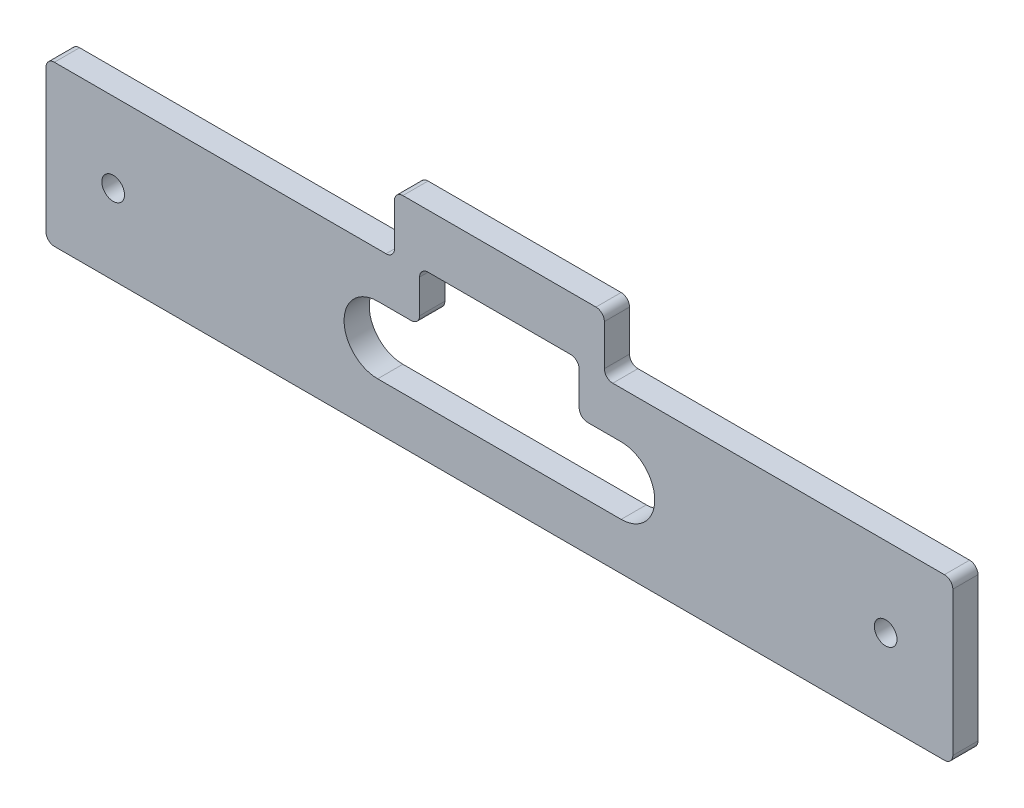
ISO-10303-21;
HEADER;
FILE_DESCRIPTION(('STEP AP214'),'2;1');
FILE_NAME('part.step','',(''),(''),'','','');
FILE_SCHEMA(('AUTOMOTIVE_DESIGN { 1 0 10303 214 1 1 1 1 }'));
ENDSEC;
DATA;
#1=APPLICATION_CONTEXT('core data for automotive mechanical design processes');
#2=APPLICATION_PROTOCOL_DEFINITION('international standard','automotive_design',2000,#1);
#3=PRODUCT_CONTEXT('',#1,'mechanical');
#4=PRODUCT('Part','Part','',(#3));
#5=PRODUCT_RELATED_PRODUCT_CATEGORY('part','',(#4));
#6=PRODUCT_DEFINITION_FORMATION('','',#4);
#7=PRODUCT_DEFINITION_CONTEXT('part definition',#1,'design');
#8=PRODUCT_DEFINITION('design','',#6,#7);
#9=PRODUCT_DEFINITION_SHAPE('','',#8);
#10=(LENGTH_UNIT() NAMED_UNIT(*) SI_UNIT(.MILLI.,.METRE.));
#11=(NAMED_UNIT(*) PLANE_ANGLE_UNIT() SI_UNIT($,.RADIAN.));
#12=(NAMED_UNIT(*) SI_UNIT($,.STERADIAN.) SOLID_ANGLE_UNIT());
#13=UNCERTAINTY_MEASURE_WITH_UNIT(LENGTH_MEASURE(1.E-05),#10,'distance_accuracy_value','');
#14=(GEOMETRIC_REPRESENTATION_CONTEXT(3) GLOBAL_UNCERTAINTY_ASSIGNED_CONTEXT((#13)) GLOBAL_UNIT_ASSIGNED_CONTEXT((#10,
#11,#12)) REPRESENTATION_CONTEXT('',''));
#15=CARTESIAN_POINT('',(0.,0.,0.));
#16=DIRECTION('',(0.,0.,1.));
#17=DIRECTION('',(1.,0.,0.));
#18=AXIS2_PLACEMENT_3D('',#15,#16,#17);
#19=CARTESIAN_POINT('',(0.,0.,15.));
#20=DIRECTION('',(1.,0.,0.));
#21=DIRECTION('',(0.,0.,-1.));
#22=AXIS2_PLACEMENT_3D('',#19,#20,#21);
#23=PLANE('',#22);
#24=DIRECTION('',(0.,-1.,0.));
#25=VECTOR('',#24,1.);
#26=CARTESIAN_POINT('',(0.,0.,15.));
#27=LINE('',#26,#25);
#28=CARTESIAN_POINT('',(0.,90.,15.));
#29=VERTEX_POINT('',#28);
#30=CARTESIAN_POINT('',(0.,5.,15.));
#31=VERTEX_POINT('',#30);
#32=EDGE_CURVE('E304',#29,#31,#27,.T.);
#33=ORIENTED_EDGE('',*,*,#32,.F.);
#34=DIRECTION('',(0.,0.,-1.));
#35=VECTOR('',#34,1.);
#36=CARTESIAN_POINT('',(0.,90.,15.));
#37=LINE('',#36,#35);
#38=CARTESIAN_POINT('',(0.,90.,0.));
#39=VERTEX_POINT('',#38);
#40=EDGE_CURVE('E421',#29,#39,#37,.T.);
#41=ORIENTED_EDGE('',*,*,#40,.T.);
#42=DIRECTION('',(0.,-1.,0.));
#43=VECTOR('',#42,1.);
#44=CARTESIAN_POINT('',(0.,0.,0.));
#45=LINE('',#44,#43);
#46=CARTESIAN_POINT('',(0.,5.,0.));
#47=VERTEX_POINT('',#46);
#48=EDGE_CURVE('E303',#39,#47,#45,.T.);
#49=ORIENTED_EDGE('',*,*,#48,.T.);
#50=DIRECTION('',(0.,0.,-1.));
#51=VECTOR('',#50,1.);
#52=CARTESIAN_POINT('',(0.,5.,15.));
#53=LINE('',#52,#51);
#54=EDGE_CURVE('E419',#47,#31,#53,.F.);
#55=ORIENTED_EDGE('',*,*,#54,.T.);
#56=EDGE_LOOP('',(#33,#41,#49,#55));
#57=FACE_BOUND('',#56,.T.);
#58=ADVANCED_FACE('F45',(#57),#23,.F.);
#59=CARTESIAN_POINT('',(0.,0.,15.));
#60=DIRECTION('',(0.,1.,0.));
#61=DIRECTION('',(0.,0.,1.));
#62=AXIS2_PLACEMENT_3D('',#59,#60,#61);
#63=PLANE('',#62);
#64=DIRECTION('',(1.,0.,0.));
#65=VECTOR('',#64,1.);
#66=CARTESIAN_POINT('',(0.,0.,15.));
#67=LINE('',#66,#65);
#68=CARTESIAN_POINT('',(5.,0.,15.));
#69=VERTEX_POINT('',#68);
#70=CARTESIAN_POINT('',(534.999504610655,0.,15.));
#71=VERTEX_POINT('',#70);
#72=EDGE_CURVE('E307',#69,#71,#67,.T.);
#73=ORIENTED_EDGE('',*,*,#72,.F.);
#74=DIRECTION('',(0.,0.,-1.));
#75=VECTOR('',#74,1.);
#76=CARTESIAN_POINT('',(5.,0.,15.));
#77=LINE('',#76,#75);
#78=CARTESIAN_POINT('',(5.,0.,0.));
#79=VERTEX_POINT('',#78);
#80=EDGE_CURVE('E443',#69,#79,#77,.T.);
#81=ORIENTED_EDGE('',*,*,#80,.T.);
#82=DIRECTION('',(1.,0.,0.));
#83=VECTOR('',#82,1.);
#84=CARTESIAN_POINT('',(0.,0.,0.));
#85=LINE('',#84,#83);
#86=CARTESIAN_POINT('',(534.999504610655,0.,0.));
#87=VERTEX_POINT('',#86);
#88=EDGE_CURVE('E330',#79,#87,#85,.T.);
#89=ORIENTED_EDGE('',*,*,#88,.T.);
#90=DIRECTION('',(0.,0.,-1.));
#91=VECTOR('',#90,1.);
#92=CARTESIAN_POINT('',(534.999504610655,0.,15.));
#93=LINE('',#92,#91);
#94=EDGE_CURVE('E441',#87,#71,#93,.F.);
#95=ORIENTED_EDGE('',*,*,#94,.T.);
#96=EDGE_LOOP('',(#73,#81,#89,#95));
#97=FACE_BOUND('',#96,.T.);
#98=ADVANCED_FACE('F511',(#97),#63,.F.);
#99=CARTESIAN_POINT('',(539.999504610655,0.,15.));
#100=DIRECTION('',(-1.,0.,0.));
#101=DIRECTION('',(0.,0.,1.));
#102=AXIS2_PLACEMENT_3D('',#99,#100,#101);
#103=PLANE('',#102);
#104=DIRECTION('',(0.,1.,0.));
#105=VECTOR('',#104,1.);
#106=CARTESIAN_POINT('',(539.999504610655,0.,15.));
#107=LINE('',#106,#105);
#108=CARTESIAN_POINT('',(539.999504610655,5.,15.));
#109=VERTEX_POINT('',#108);
#110=CARTESIAN_POINT('',(539.999504610655,90.7314507823298,15.));
#111=VERTEX_POINT('',#110);
#112=EDGE_CURVE('E311',#109,#111,#107,.T.);
#113=ORIENTED_EDGE('',*,*,#112,.F.);
#114=DIRECTION('',(0.,0.,-1.));
#115=VECTOR('',#114,1.);
#116=CARTESIAN_POINT('',(539.999504610655,5.,15.));
#117=LINE('',#116,#115);
#118=CARTESIAN_POINT('',(539.999504610655,5.,0.));
#119=VERTEX_POINT('',#118);
#120=EDGE_CURVE('E53',#109,#119,#117,.T.);
#121=ORIENTED_EDGE('',*,*,#120,.T.);
#122=DIRECTION('',(0.,1.,0.));
#123=VECTOR('',#122,1.);
#124=CARTESIAN_POINT('',(539.999504610655,0.,0.));
#125=LINE('',#124,#123);
#126=CARTESIAN_POINT('',(539.999504610655,90.7314507823298,0.));
#127=VERTEX_POINT('',#126);
#128=EDGE_CURVE('E333',#119,#127,#125,.T.);
#129=ORIENTED_EDGE('',*,*,#128,.T.);
#130=DIRECTION('',(0.,0.,-1.));
#131=VECTOR('',#130,1.);
#132=CARTESIAN_POINT('',(539.999504610655,90.7314507823298,15.));
#133=LINE('',#132,#131);
#134=EDGE_CURVE('E68',#127,#111,#133,.F.);
#135=ORIENTED_EDGE('',*,*,#134,.T.);
#136=EDGE_LOOP('',(#113,#121,#129,#135));
#137=FACE_BOUND('',#136,.T.);
#138=ADVANCED_FACE('F449',(#137),#103,.F.);
#139=CARTESIAN_POINT('',(332.5,95.7314507823298,15.));
#140=DIRECTION('',(0.,-1.,0.));
#141=DIRECTION('',(0.,0.,-1.));
#142=AXIS2_PLACEMENT_3D('',#139,#140,#141);
#143=PLANE('',#142);
#144=DIRECTION('',(-1.,0.,0.));
#145=VECTOR('',#144,1.);
#146=CARTESIAN_POINT('',(332.5,95.7314507823298,15.));
#147=LINE('',#146,#145);
#148=CARTESIAN_POINT('',(534.999504610655,95.7314507823298,15.));
#149=VERTEX_POINT('',#148);
#150=CARTESIAN_POINT('',(337.5,95.7314507823298,15.));
#151=VERTEX_POINT('',#150);
#152=EDGE_CURVE('E313',#149,#151,#147,.T.);
#153=ORIENTED_EDGE('',*,*,#152,.F.);
#154=DIRECTION('',(0.,0.,-1.));
#155=VECTOR('',#154,1.);
#156=CARTESIAN_POINT('',(534.999504610655,95.7314507823298,15.));
#157=LINE('',#156,#155);
#158=CARTESIAN_POINT('',(534.999504610655,95.7314507823298,0.));
#159=VERTEX_POINT('',#158);
#160=EDGE_CURVE('E13',#149,#159,#157,.T.);
#161=ORIENTED_EDGE('',*,*,#160,.T.);
#162=DIRECTION('',(-1.,0.,0.));
#163=VECTOR('',#162,1.);
#164=CARTESIAN_POINT('',(332.5,95.7314507823298,0.));
#165=LINE('',#164,#163);
#166=CARTESIAN_POINT('',(337.5,95.7314507823298,0.));
#167=VERTEX_POINT('',#166);
#168=EDGE_CURVE('E335',#159,#167,#165,.T.);
#169=ORIENTED_EDGE('',*,*,#168,.T.);
#170=DIRECTION('',(0.,0.,-1.));
#171=VECTOR('',#170,1.);
#172=CARTESIAN_POINT('',(337.5,95.7314507823298,15.));
#173=LINE('',#172,#171);
#174=EDGE_CURVE('E352',#167,#151,#173,.F.);
#175=ORIENTED_EDGE('',*,*,#174,.T.);
#176=EDGE_LOOP('',(#153,#161,#169,#175));
#177=FACE_BOUND('',#176,.T.);
#178=ADVANCED_FACE('F459',(#177),#143,.F.);
#179=CARTESIAN_POINT('',(332.5,130.,15.));
#180=DIRECTION('',(-1.,0.,0.));
#181=DIRECTION('',(0.,-1.,0.));
#182=AXIS2_PLACEMENT_3D('',#179,#180,#181);
#183=PLANE('',#182);
#184=DIRECTION('',(0.,1.,0.));
#185=VECTOR('',#184,1.);
#186=CARTESIAN_POINT('',(332.5,130.,15.));
#187=LINE('',#186,#185);
#188=CARTESIAN_POINT('',(332.5,100.73145078233,15.));
#189=VERTEX_POINT('',#188);
#190=CARTESIAN_POINT('',(332.5,125.,15.));
#191=VERTEX_POINT('',#190);
#192=EDGE_CURVE('E315',#189,#191,#187,.T.);
#193=ORIENTED_EDGE('',*,*,#192,.F.);
#194=DIRECTION('',(0.,0.,-1.));
#195=VECTOR('',#194,1.);
#196=CARTESIAN_POINT('',(332.5,100.73145078233,0.));
#197=LINE('',#196,#195);
#198=CARTESIAN_POINT('',(332.5,100.73145078233,0.));
#199=VERTEX_POINT('',#198);
#200=EDGE_CURVE('E349',#189,#199,#197,.T.);
#201=ORIENTED_EDGE('',*,*,#200,.T.);
#202=DIRECTION('',(0.,1.,0.));
#203=VECTOR('',#202,1.);
#204=CARTESIAN_POINT('',(332.5,130.,0.));
#205=LINE('',#204,#203);
#206=CARTESIAN_POINT('',(332.5,125.,0.));
#207=VERTEX_POINT('',#206);
#208=EDGE_CURVE('E337',#199,#207,#205,.T.);
#209=ORIENTED_EDGE('',*,*,#208,.T.);
#210=DIRECTION('',(0.,0.,-1.));
#211=VECTOR('',#210,1.);
#212=CARTESIAN_POINT('',(332.5,125.,15.));
#213=LINE('',#212,#211);
#214=EDGE_CURVE('E327',#207,#191,#213,.F.);
#215=ORIENTED_EDGE('',*,*,#214,.T.);
#216=EDGE_LOOP('',(#193,#201,#209,#215));
#217=FACE_BOUND('',#216,.T.);
#218=ADVANCED_FACE('F468',(#217),#183,.F.);
#219=CARTESIAN_POINT('',(207.5,130.,15.));
#220=DIRECTION('',(0.,-1.,0.));
#221=DIRECTION('',(0.,0.,-1.));
#222=AXIS2_PLACEMENT_3D('',#219,#220,#221);
#223=PLANE('',#222);
#224=DIRECTION('',(-1.,0.,0.));
#225=VECTOR('',#224,1.);
#226=CARTESIAN_POINT('',(207.5,130.,15.));
#227=LINE('',#226,#225);
#228=CARTESIAN_POINT('',(327.5,130.,15.));
#229=VERTEX_POINT('',#228);
#230=CARTESIAN_POINT('',(212.5,130.,15.));
#231=VERTEX_POINT('',#230);
#232=EDGE_CURVE('E318',#229,#231,#227,.T.);
#233=ORIENTED_EDGE('',*,*,#232,.F.);
#234=DIRECTION('',(0.,0.,-1.));
#235=VECTOR('',#234,1.);
#236=CARTESIAN_POINT('',(327.5,130.,15.));
#237=LINE('',#236,#235);
#238=CARTESIAN_POINT('',(327.5,130.,0.));
#239=VERTEX_POINT('',#238);
#240=EDGE_CURVE('E357',#229,#239,#237,.T.);
#241=ORIENTED_EDGE('',*,*,#240,.T.);
#242=DIRECTION('',(-1.,0.,0.));
#243=VECTOR('',#242,1.);
#244=CARTESIAN_POINT('',(207.5,130.,0.));
#245=LINE('',#244,#243);
#246=CARTESIAN_POINT('',(212.5,130.,0.));
#247=VERTEX_POINT('',#246);
#248=EDGE_CURVE('E340',#239,#247,#245,.T.);
#249=ORIENTED_EDGE('',*,*,#248,.T.);
#250=DIRECTION('',(0.,0.,-1.));
#251=VECTOR('',#250,1.);
#252=CARTESIAN_POINT('',(212.5,130.,15.));
#253=LINE('',#252,#251);
#254=EDGE_CURVE('E355',#247,#231,#253,.F.);
#255=ORIENTED_EDGE('',*,*,#254,.T.);
#256=EDGE_LOOP('',(#233,#241,#249,#255));
#257=FACE_BOUND('',#256,.T.);
#258=ADVANCED_FACE('F479',(#257),#223,.F.);
#259=CARTESIAN_POINT('',(207.5,95.,15.));
#260=DIRECTION('',(1.,0.,0.));
#261=DIRECTION('',(0.,0.,-1.));
#262=AXIS2_PLACEMENT_3D('',#259,#260,#261);
#263=PLANE('',#262);
#264=DIRECTION('',(0.,-1.,0.));
#265=VECTOR('',#264,1.);
#266=CARTESIAN_POINT('',(207.5,95.,15.));
#267=LINE('',#266,#265);
#268=CARTESIAN_POINT('',(207.5,125.,15.));
#269=VERTEX_POINT('',#268);
#270=CARTESIAN_POINT('',(207.5,100.,15.));
#271=VERTEX_POINT('',#270);
#272=EDGE_CURVE('E321',#269,#271,#267,.T.);
#273=ORIENTED_EDGE('',*,*,#272,.F.);
#274=DIRECTION('',(0.,0.,-1.));
#275=VECTOR('',#274,1.);
#276=CARTESIAN_POINT('',(207.5,125.,15.));
#277=LINE('',#276,#275);
#278=CARTESIAN_POINT('',(207.5,125.,0.));
#279=VERTEX_POINT('',#278);
#280=EDGE_CURVE('E370',#269,#279,#277,.T.);
#281=ORIENTED_EDGE('',*,*,#280,.T.);
#282=DIRECTION('',(0.,-1.,0.));
#283=VECTOR('',#282,1.);
#284=CARTESIAN_POINT('',(207.5,95.,0.));
#285=LINE('',#284,#283);
#286=CARTESIAN_POINT('',(207.5,100.,0.));
#287=VERTEX_POINT('',#286);
#288=EDGE_CURVE('E343',#279,#287,#285,.T.);
#289=ORIENTED_EDGE('',*,*,#288,.T.);
#290=DIRECTION('',(0.,0.,-1.));
#291=VECTOR('',#290,1.);
#292=CARTESIAN_POINT('',(207.5,100.,15.));
#293=LINE('',#292,#291);
#294=EDGE_CURVE('E368',#287,#271,#293,.F.);
#295=ORIENTED_EDGE('',*,*,#294,.T.);
#296=EDGE_LOOP('',(#273,#281,#289,#295));
#297=FACE_BOUND('',#296,.T.);
#298=ADVANCED_FACE('F487',(#297),#263,.F.);
#299=CARTESIAN_POINT('',(0.,95.,15.));
#300=DIRECTION('',(0.,-1.,0.));
#301=DIRECTION('',(0.,0.,-1.));
#302=AXIS2_PLACEMENT_3D('',#299,#300,#301);
#303=PLANE('',#302);
#304=DIRECTION('',(-1.,0.,0.));
#305=VECTOR('',#304,1.);
#306=CARTESIAN_POINT('',(0.,95.,0.));
#307=LINE('',#306,#305);
#308=CARTESIAN_POINT('',(202.5,95.,0.));
#309=VERTEX_POINT('',#308);
#310=CARTESIAN_POINT('',(5.,95.,0.));
#311=VERTEX_POINT('',#310);
#312=EDGE_CURVE('E308',#309,#311,#307,.T.);
#313=ORIENTED_EDGE('',*,*,#312,.T.);
#314=DIRECTION('',(0.,0.,-1.));
#315=VECTOR('',#314,1.);
#316=CARTESIAN_POINT('',(5.,95.,15.));
#317=LINE('',#316,#315);
#318=CARTESIAN_POINT('',(5.,95.,15.));
#319=VERTEX_POINT('',#318);
#320=EDGE_CURVE('E432',#311,#319,#317,.F.);
#321=ORIENTED_EDGE('',*,*,#320,.T.);
#322=DIRECTION('',(-1.,0.,0.));
#323=VECTOR('',#322,1.);
#324=CARTESIAN_POINT('',(0.,95.,15.));
#325=LINE('',#324,#323);
#326=CARTESIAN_POINT('',(202.5,95.,15.));
#327=VERTEX_POINT('',#326);
#328=EDGE_CURVE('E324',#327,#319,#325,.T.);
#329=ORIENTED_EDGE('',*,*,#328,.F.);
#330=DIRECTION('',(0.,0.,-1.));
#331=VECTOR('',#330,1.);
#332=CARTESIAN_POINT('',(202.5,95.,0.));
#333=LINE('',#332,#331);
#334=EDGE_CURVE('E373',#327,#309,#333,.T.);
#335=ORIENTED_EDGE('',*,*,#334,.T.);
#336=EDGE_LOOP('',(#313,#321,#329,#335));
#337=FACE_BOUND('',#336,.T.);
#338=ADVANCED_FACE('F496',(#337),#303,.F.);
#339=CARTESIAN_POINT('',(0.,0.,15.));
#340=DIRECTION('',(0.,0.,-1.));
#341=DIRECTION('',(-1.,0.,0.));
#342=AXIS2_PLACEMENT_3D('',#339,#340,#341);
#343=PLANE('',#342);
#344=DIRECTION('',(0.,-1.,0.));
#345=VECTOR('',#344,1.);
#346=CARTESIAN_POINT('',(317.499504610655,0.,15.));
#347=LINE('',#346,#345);
#348=CARTESIAN_POINT('',(317.499504610655,93.,15.));
#349=VERTEX_POINT('',#348);
#350=CARTESIAN_POINT('',(317.499504610655,73.,15.));
#351=VERTEX_POINT('',#350);
#352=EDGE_CURVE('E279',#349,#351,#347,.T.);
#353=ORIENTED_EDGE('',*,*,#352,.T.);
#354=CARTESIAN_POINT('',(322.499504610655,73.,15.));
#355=DIRECTION('',(0.,0.,-1.));
#356=DIRECTION('',(-1.,0.,0.));
#357=AXIS2_PLACEMENT_3D('',#354,#355,#356);
#358=CIRCLE('',#357,5.);
#359=CARTESIAN_POINT('',(322.499504610655,68.,15.));
#360=VERTEX_POINT('',#359);
#361=EDGE_CURVE('E397',#351,#360,#358,.F.);
#362=ORIENTED_EDGE('',*,*,#361,.T.);
#363=DIRECTION('',(1.,0.,0.));
#364=VECTOR('',#363,1.);
#365=CARTESIAN_POINT('',(0.,68.,15.));
#366=LINE('',#365,#364);
#367=CARTESIAN_POINT('',(342.499504610655,68.,15.));
#368=VERTEX_POINT('',#367);
#369=EDGE_CURVE('E282',#360,#368,#366,.T.);
#370=ORIENTED_EDGE('',*,*,#369,.T.);
#371=CARTESIAN_POINT('',(342.499504610655,48.,15.));
#372=DIRECTION('',(0.,0.,-1.));
#373=DIRECTION('',(-1.,0.,0.));
#374=AXIS2_PLACEMENT_3D('',#371,#372,#373);
#375=CIRCLE('',#374,20.);
#376=CARTESIAN_POINT('',(342.499504610655,28.,15.));
#377=VERTEX_POINT('',#376);
#378=EDGE_CURVE('E252',#368,#377,#375,.T.);
#379=ORIENTED_EDGE('',*,*,#378,.T.);
#380=DIRECTION('',(-1.,0.,0.));
#381=VECTOR('',#380,1.);
#382=CARTESIAN_POINT('',(0.,28.,15.));
#383=LINE('',#382,#381);
#384=CARTESIAN_POINT('',(197.499504610655,28.,15.));
#385=VERTEX_POINT('',#384);
#386=EDGE_CURVE('E285',#377,#385,#383,.T.);
#387=ORIENTED_EDGE('',*,*,#386,.T.);
#388=CARTESIAN_POINT('',(197.499504610655,48.,15.));
#389=DIRECTION('',(0.,0.,-1.));
#390=DIRECTION('',(-1.,0.,0.));
#391=AXIS2_PLACEMENT_3D('',#388,#389,#390);
#392=CIRCLE('',#391,20.);
#393=CARTESIAN_POINT('',(197.499504610655,68.,15.));
#394=VERTEX_POINT('',#393);
#395=EDGE_CURVE('E288',#385,#394,#392,.T.);
#396=ORIENTED_EDGE('',*,*,#395,.T.);
#397=DIRECTION('',(1.,0.,0.));
#398=VECTOR('',#397,1.);
#399=CARTESIAN_POINT('',(0.,68.,15.));
#400=LINE('',#399,#398);
#401=CARTESIAN_POINT('',(217.499504610655,68.,15.));
#402=VERTEX_POINT('',#401);
#403=EDGE_CURVE('E267',#394,#402,#400,.T.);
#404=ORIENTED_EDGE('',*,*,#403,.T.);
#405=CARTESIAN_POINT('',(217.499504610655,73.,15.));
#406=DIRECTION('',(0.,0.,-1.));
#407=DIRECTION('',(-1.,0.,0.));
#408=AXIS2_PLACEMENT_3D('',#405,#406,#407);
#409=CIRCLE('',#408,5.);
#410=CARTESIAN_POINT('',(222.499504610655,73.,15.));
#411=VERTEX_POINT('',#410);
#412=EDGE_CURVE('E395',#402,#411,#409,.F.);
#413=ORIENTED_EDGE('',*,*,#412,.T.);
#414=DIRECTION('',(0.,1.,0.));
#415=VECTOR('',#414,1.);
#416=CARTESIAN_POINT('',(222.499504610655,0.,15.));
#417=LINE('',#416,#415);
#418=CARTESIAN_POINT('',(222.499504610655,93.,15.));
#419=VERTEX_POINT('',#418);
#420=EDGE_CURVE('E273',#411,#419,#417,.T.);
#421=ORIENTED_EDGE('',*,*,#420,.T.);
#422=CARTESIAN_POINT('',(227.499504610655,93.,15.));
#423=DIRECTION('',(0.,0.,-1.));
#424=DIRECTION('',(-1.,0.,0.));
#425=AXIS2_PLACEMENT_3D('',#422,#423,#424);
#426=CIRCLE('',#425,5.);
#427=CARTESIAN_POINT('',(227.499504610655,98.,15.));
#428=VERTEX_POINT('',#427);
#429=EDGE_CURVE('E417',#419,#428,#426,.T.);
#430=ORIENTED_EDGE('',*,*,#429,.T.);
#431=DIRECTION('',(1.,0.,0.));
#432=VECTOR('',#431,1.);
#433=CARTESIAN_POINT('',(0.,98.,15.));
#434=LINE('',#433,#432);
#435=CARTESIAN_POINT('',(312.499504610655,98.,15.));
#436=VERTEX_POINT('',#435);
#437=EDGE_CURVE('E276',#428,#436,#434,.T.);
#438=ORIENTED_EDGE('',*,*,#437,.T.);
#439=CARTESIAN_POINT('',(312.499504610655,93.,15.));
#440=DIRECTION('',(0.,0.,-1.));
#441=DIRECTION('',(-1.,0.,0.));
#442=AXIS2_PLACEMENT_3D('',#439,#440,#441);
#443=CIRCLE('',#442,5.);
#444=EDGE_CURVE('E413',#436,#349,#443,.T.);
#445=ORIENTED_EDGE('',*,*,#444,.T.);
#446=EDGE_LOOP('',(#353,#362,#370,#379,#387,#396,#404,#413,#421,#430,#438,#445));
#447=FACE_BOUND('',#446,.T.);
#448=CARTESIAN_POINT('',(40.,47.5,15.));
#449=DIRECTION('',(0.,0.,-1.));
#450=DIRECTION('',(-1.,0.,0.));
#451=AXIS2_PLACEMENT_3D('',#448,#449,#450);
#452=CIRCLE('',#451,6.75);
#453=CARTESIAN_POINT('',(33.25,47.5,15.));
#454=VERTEX_POINT('',#453);
#455=EDGE_CURVE('E294',#454,#454,#452,.T.);
#456=ORIENTED_EDGE('',*,*,#455,.T.);
#457=EDGE_LOOP('',(#456));
#458=FACE_BOUND('',#457,.T.);
#459=CARTESIAN_POINT('',(499.999504610655,48.2314507823298,15.));
#460=DIRECTION('',(0.,0.,-1.));
#461=DIRECTION('',(-1.,0.,0.));
#462=AXIS2_PLACEMENT_3D('',#459,#460,#461);
#463=CIRCLE('',#462,6.74999999999998);
#464=CARTESIAN_POINT('',(493.249504610655,48.2314507823298,15.));
#465=VERTEX_POINT('',#464);
#466=EDGE_CURVE('E300',#465,#465,#463,.T.);
#467=ORIENTED_EDGE('',*,*,#466,.T.);
#468=EDGE_LOOP('',(#467));
#469=FACE_BOUND('',#468,.T.);
#470=ORIENTED_EDGE('',*,*,#328,.T.);
#471=CARTESIAN_POINT('',(5.,90.,15.));
#472=DIRECTION('',(0.,0.,-1.));
#473=DIRECTION('',(-1.,0.,0.));
#474=AXIS2_PLACEMENT_3D('',#471,#472,#473);
#475=CIRCLE('',#474,5.);
#476=EDGE_CURVE('E439',#319,#29,#475,.F.);
#477=ORIENTED_EDGE('',*,*,#476,.T.);
#478=ORIENTED_EDGE('',*,*,#32,.T.);
#479=CARTESIAN_POINT('',(5.,5.,15.));
#480=DIRECTION('',(0.,0.,-1.));
#481=DIRECTION('',(-1.,0.,0.));
#482=AXIS2_PLACEMENT_3D('',#479,#480,#481);
#483=CIRCLE('',#482,5.);
#484=EDGE_CURVE('E437',#31,#69,#483,.F.);
#485=ORIENTED_EDGE('',*,*,#484,.T.);
#486=ORIENTED_EDGE('',*,*,#72,.T.);
#487=CARTESIAN_POINT('',(534.999504610655,5.,15.));
#488=DIRECTION('',(0.,0.,-1.));
#489=DIRECTION('',(-1.,0.,0.));
#490=AXIS2_PLACEMENT_3D('',#487,#488,#489);
#491=CIRCLE('',#490,5.);
#492=EDGE_CURVE('E435',#71,#109,#491,.F.);
#493=ORIENTED_EDGE('',*,*,#492,.T.);
#494=ORIENTED_EDGE('',*,*,#112,.T.);
#495=CARTESIAN_POINT('',(534.999504610655,90.7314507823298,15.));
#496=DIRECTION('',(0.,0.,-1.));
#497=DIRECTION('',(-1.,0.,0.));
#498=AXIS2_PLACEMENT_3D('',#495,#496,#497);
#499=CIRCLE('',#498,5.);
#500=EDGE_CURVE('E60',#111,#149,#499,.F.);
#501=ORIENTED_EDGE('',*,*,#500,.T.);
#502=ORIENTED_EDGE('',*,*,#152,.T.);
#503=CARTESIAN_POINT('',(337.5,100.73145078233,15.));
#504=DIRECTION('',(0.,0.,-1.));
#505=DIRECTION('',(-1.,0.,0.));
#506=AXIS2_PLACEMENT_3D('',#503,#504,#505);
#507=CIRCLE('',#506,5.);
#508=EDGE_CURVE('E379',#151,#189,#507,.T.);
#509=ORIENTED_EDGE('',*,*,#508,.T.);
#510=ORIENTED_EDGE('',*,*,#192,.T.);
#511=CARTESIAN_POINT('',(327.5,125.,15.));
#512=DIRECTION('',(0.,0.,-1.));
#513=DIRECTION('',(-1.,0.,0.));
#514=AXIS2_PLACEMENT_3D('',#511,#512,#513);
#515=CIRCLE('',#514,5.);
#516=EDGE_CURVE('E366',#191,#229,#515,.F.);
#517=ORIENTED_EDGE('',*,*,#516,.T.);
#518=ORIENTED_EDGE('',*,*,#232,.T.);
#519=CARTESIAN_POINT('',(212.5,125.,15.));
#520=DIRECTION('',(0.,0.,-1.));
#521=DIRECTION('',(-1.,0.,0.));
#522=AXIS2_PLACEMENT_3D('',#519,#520,#521);
#523=CIRCLE('',#522,5.);
#524=EDGE_CURVE('E364',#231,#269,#523,.F.);
#525=ORIENTED_EDGE('',*,*,#524,.T.);
#526=ORIENTED_EDGE('',*,*,#272,.T.);
#527=CARTESIAN_POINT('',(202.5,100.,15.));
#528=DIRECTION('',(0.,0.,-1.));
#529=DIRECTION('',(-1.,0.,0.));
#530=AXIS2_PLACEMENT_3D('',#527,#528,#529);
#531=CIRCLE('',#530,5.);
#532=EDGE_CURVE('E383',#271,#327,#531,.T.);
#533=ORIENTED_EDGE('',*,*,#532,.T.);
#534=EDGE_LOOP('',(#470,#477,#478,#485,#486,#493,#494,#501,#502,#509,#510,#517,#518,#525,#526,#533));
#535=FACE_BOUND('',#534,.T.);
#536=ADVANCED_FACE('F462',(#447,#458,#469,#535),#343,.F.);
#537=CARTESIAN_POINT('',(0.,0.,0.));
#538=DIRECTION('',(0.,0.,-1.));
#539=DIRECTION('',(-1.,0.,0.));
#540=AXIS2_PLACEMENT_3D('',#537,#538,#539);
#541=PLANE('',#540);
#542=DIRECTION('',(1.,0.,0.));
#543=VECTOR('',#542,1.);
#544=CARTESIAN_POINT('',(342.499504610655,68.,0.));
#545=LINE('',#544,#543);
#546=CARTESIAN_POINT('',(322.499504610655,68.,0.));
#547=VERTEX_POINT('',#546);
#548=CARTESIAN_POINT('',(342.499504610655,68.,0.));
#549=VERTEX_POINT('',#548);
#550=EDGE_CURVE('E233',#547,#549,#545,.T.);
#551=ORIENTED_EDGE('',*,*,#550,.F.);
#552=CARTESIAN_POINT('',(322.499504610655,73.,0.));
#553=DIRECTION('',(0.,0.,-1.));
#554=DIRECTION('',(-1.,0.,0.));
#555=AXIS2_PLACEMENT_3D('',#552,#553,#554);
#556=CIRCLE('',#555,5.);
#557=CARTESIAN_POINT('',(317.499504610655,73.,0.));
#558=VERTEX_POINT('',#557);
#559=EDGE_CURVE('E388',#547,#558,#556,.T.);
#560=ORIENTED_EDGE('',*,*,#559,.T.);
#561=DIRECTION('',(0.,-1.,0.));
#562=VECTOR('',#561,1.);
#563=CARTESIAN_POINT('',(317.499504610655,68.,0.));
#564=LINE('',#563,#562);
#565=CARTESIAN_POINT('',(317.499504610655,93.,0.));
#566=VERTEX_POINT('',#565);
#567=EDGE_CURVE('E243',#566,#558,#564,.T.);
#568=ORIENTED_EDGE('',*,*,#567,.F.);
#569=CARTESIAN_POINT('',(312.499504610655,93.,0.));
#570=DIRECTION('',(0.,0.,-1.));
#571=DIRECTION('',(-1.,0.,0.));
#572=AXIS2_PLACEMENT_3D('',#569,#570,#571);
#573=CIRCLE('',#572,5.);
#574=CARTESIAN_POINT('',(312.499504610655,98.,0.));
#575=VERTEX_POINT('',#574);
#576=EDGE_CURVE('E411',#566,#575,#573,.F.);
#577=ORIENTED_EDGE('',*,*,#576,.T.);
#578=DIRECTION('',(1.,0.,0.));
#579=VECTOR('',#578,1.);
#580=CARTESIAN_POINT('',(317.499504610655,98.,0.));
#581=LINE('',#580,#579);
#582=CARTESIAN_POINT('',(227.499504610655,98.,0.));
#583=VERTEX_POINT('',#582);
#584=EDGE_CURVE('E809',#583,#575,#581,.T.);
#585=ORIENTED_EDGE('',*,*,#584,.F.);
#586=CARTESIAN_POINT('',(227.499504610655,93.,0.));
#587=DIRECTION('',(0.,0.,-1.));
#588=DIRECTION('',(-1.,0.,0.));
#589=AXIS2_PLACEMENT_3D('',#586,#587,#588);
#590=CIRCLE('',#589,5.);
#591=CARTESIAN_POINT('',(222.499504610655,93.,0.));
#592=VERTEX_POINT('',#591);
#593=EDGE_CURVE('E415',#583,#592,#590,.F.);
#594=ORIENTED_EDGE('',*,*,#593,.T.);
#595=DIRECTION('',(0.,1.,0.));
#596=VECTOR('',#595,1.);
#597=CARTESIAN_POINT('',(222.499504610655,98.,0.));
#598=LINE('',#597,#596);
#599=CARTESIAN_POINT('',(222.499504610655,73.,0.));
#600=VERTEX_POINT('',#599);
#601=EDGE_CURVE('E811',#600,#592,#598,.T.);
#602=ORIENTED_EDGE('',*,*,#601,.F.);
#603=CARTESIAN_POINT('',(217.499504610655,73.,0.));
#604=DIRECTION('',(0.,0.,-1.));
#605=DIRECTION('',(-1.,0.,0.));
#606=AXIS2_PLACEMENT_3D('',#603,#604,#605);
#607=CIRCLE('',#606,5.);
#608=CARTESIAN_POINT('',(217.499504610655,68.,0.));
#609=VERTEX_POINT('',#608);
#610=EDGE_CURVE('E386',#600,#609,#607,.T.);
#611=ORIENTED_EDGE('',*,*,#610,.T.);
#612=DIRECTION('',(1.,0.,0.));
#613=VECTOR('',#612,1.);
#614=CARTESIAN_POINT('',(222.499504610655,68.,0.));
#615=LINE('',#614,#613);
#616=CARTESIAN_POINT('',(197.499504610655,68.,0.));
#617=VERTEX_POINT('',#616);
#618=EDGE_CURVE('E816',#617,#609,#615,.T.);
#619=ORIENTED_EDGE('',*,*,#618,.F.);
#620=CARTESIAN_POINT('',(197.499504610655,48.,0.));
#621=DIRECTION('',(0.,0.,-1.));
#622=DIRECTION('',(1.,0.,0.));
#623=AXIS2_PLACEMENT_3D('',#620,#621,#622);
#624=CIRCLE('',#623,20.);
#625=CARTESIAN_POINT('',(197.499504610655,28.,0.));
#626=VERTEX_POINT('',#625);
#627=EDGE_CURVE('E819',#626,#617,#624,.T.);
#628=ORIENTED_EDGE('',*,*,#627,.F.);
#629=DIRECTION('',(-1.,0.,0.));
#630=VECTOR('',#629,1.);
#631=CARTESIAN_POINT('',(197.499504610655,28.,0.));
#632=LINE('',#631,#630);
#633=CARTESIAN_POINT('',(342.499504610655,28.,0.));
#634=VERTEX_POINT('',#633);
#635=EDGE_CURVE('E260',#634,#626,#632,.T.);
#636=ORIENTED_EDGE('',*,*,#635,.F.);
#637=CARTESIAN_POINT('',(342.499504610655,48.,0.));
#638=DIRECTION('',(0.,0.,-1.));
#639=DIRECTION('',(-1.,0.,0.));
#640=AXIS2_PLACEMENT_3D('',#637,#638,#639);
#641=CIRCLE('',#640,20.);
#642=EDGE_CURVE('E242',#549,#634,#641,.T.);
#643=ORIENTED_EDGE('',*,*,#642,.F.);
#644=EDGE_LOOP('',(#551,#560,#568,#577,#585,#594,#602,#611,#619,#628,#636,#643));
#645=FACE_BOUND('',#644,.T.);
#646=CARTESIAN_POINT('',(40.,47.5,0.));
#647=DIRECTION('',(0.,0.,-1.));
#648=DIRECTION('',(-1.,0.,0.));
#649=AXIS2_PLACEMENT_3D('',#646,#647,#648);
#650=CIRCLE('',#649,6.75);
#651=CARTESIAN_POINT('',(33.25,47.5,0.));
#652=VERTEX_POINT('',#651);
#653=EDGE_CURVE('E291',#652,#652,#650,.T.);
#654=ORIENTED_EDGE('',*,*,#653,.F.);
#655=EDGE_LOOP('',(#654));
#656=FACE_BOUND('',#655,.T.);
#657=CARTESIAN_POINT('',(499.999504610655,48.2314507823298,0.));
#658=DIRECTION('',(0.,0.,-1.));
#659=DIRECTION('',(-1.,0.,0.));
#660=AXIS2_PLACEMENT_3D('',#657,#658,#659);
#661=CIRCLE('',#660,6.74999999999998);
#662=CARTESIAN_POINT('',(493.249504610655,48.2314507823298,0.));
#663=VERTEX_POINT('',#662);
#664=EDGE_CURVE('E297',#663,#663,#661,.T.);
#665=ORIENTED_EDGE('',*,*,#664,.F.);
#666=EDGE_LOOP('',(#665));
#667=FACE_BOUND('',#666,.T.);
#668=ORIENTED_EDGE('',*,*,#48,.F.);
#669=CARTESIAN_POINT('',(5.,90.,0.));
#670=DIRECTION('',(0.,0.,-1.));
#671=DIRECTION('',(-1.,0.,0.));
#672=AXIS2_PLACEMENT_3D('',#669,#670,#671);
#673=CIRCLE('',#672,5.);
#674=EDGE_CURVE('E430',#39,#311,#673,.T.);
#675=ORIENTED_EDGE('',*,*,#674,.T.);
#676=ORIENTED_EDGE('',*,*,#312,.F.);
#677=CARTESIAN_POINT('',(202.5,100.,0.));
#678=DIRECTION('',(0.,0.,-1.));
#679=DIRECTION('',(-1.,0.,0.));
#680=AXIS2_PLACEMENT_3D('',#677,#678,#679);
#681=CIRCLE('',#680,5.);
#682=EDGE_CURVE('E381',#309,#287,#681,.F.);
#683=ORIENTED_EDGE('',*,*,#682,.T.);
#684=ORIENTED_EDGE('',*,*,#288,.F.);
#685=CARTESIAN_POINT('',(212.5,125.,0.));
#686=DIRECTION('',(0.,0.,-1.));
#687=DIRECTION('',(-1.,0.,0.));
#688=AXIS2_PLACEMENT_3D('',#685,#686,#687);
#689=CIRCLE('',#688,5.);
#690=EDGE_CURVE('E360',#279,#247,#689,.T.);
#691=ORIENTED_EDGE('',*,*,#690,.T.);
#692=ORIENTED_EDGE('',*,*,#248,.F.);
#693=CARTESIAN_POINT('',(327.5,125.,0.));
#694=DIRECTION('',(0.,0.,-1.));
#695=DIRECTION('',(-1.,0.,0.));
#696=AXIS2_PLACEMENT_3D('',#693,#694,#695);
#697=CIRCLE('',#696,5.);
#698=EDGE_CURVE('E362',#239,#207,#697,.T.);
#699=ORIENTED_EDGE('',*,*,#698,.T.);
#700=ORIENTED_EDGE('',*,*,#208,.F.);
#701=CARTESIAN_POINT('',(337.5,100.73145078233,0.));
#702=DIRECTION('',(0.,0.,-1.));
#703=DIRECTION('',(-1.,0.,0.));
#704=AXIS2_PLACEMENT_3D('',#701,#702,#703);
#705=CIRCLE('',#704,5.);
#706=EDGE_CURVE('E376',#199,#167,#705,.F.);
#707=ORIENTED_EDGE('',*,*,#706,.T.);
#708=ORIENTED_EDGE('',*,*,#168,.F.);
#709=CARTESIAN_POINT('',(534.999504610655,90.7314507823298,0.));
#710=DIRECTION('',(0.,0.,-1.));
#711=DIRECTION('',(-1.,0.,0.));
#712=AXIS2_PLACEMENT_3D('',#709,#710,#711);
#713=CIRCLE('',#712,5.);
#714=EDGE_CURVE('E424',#159,#127,#713,.T.);
#715=ORIENTED_EDGE('',*,*,#714,.T.);
#716=ORIENTED_EDGE('',*,*,#128,.F.);
#717=CARTESIAN_POINT('',(534.999504610655,5.,0.));
#718=DIRECTION('',(0.,0.,-1.));
#719=DIRECTION('',(-1.,0.,0.));
#720=AXIS2_PLACEMENT_3D('',#717,#718,#719);
#721=CIRCLE('',#720,5.);
#722=EDGE_CURVE('E426',#119,#87,#721,.T.);
#723=ORIENTED_EDGE('',*,*,#722,.T.);
#724=ORIENTED_EDGE('',*,*,#88,.F.);
#725=CARTESIAN_POINT('',(5.,5.,0.));
#726=DIRECTION('',(0.,0.,-1.));
#727=DIRECTION('',(-1.,0.,0.));
#728=AXIS2_PLACEMENT_3D('',#725,#726,#727);
#729=CIRCLE('',#728,5.);
#730=EDGE_CURVE('E428',#79,#47,#729,.T.);
#731=ORIENTED_EDGE('',*,*,#730,.T.);
#732=EDGE_LOOP('',(#668,#675,#676,#683,#684,#691,#692,#699,#700,#707,#708,#715,#716,#723,#724,#731));
#733=FACE_BOUND('',#732,.T.);
#734=ADVANCED_FACE('F256',(#645,#656,#667,#733),#541,.T.);
#735=CARTESIAN_POINT('',(499.999504610655,48.2314507823298,0.));
#736=DIRECTION('',(0.,0.,-1.));
#737=DIRECTION('',(-1.,0.,0.));
#738=AXIS2_PLACEMENT_3D('',#735,#736,#737);
#739=CYLINDRICAL_SURFACE('',#738,6.74999999999998);
#740=ORIENTED_EDGE('',*,*,#466,.F.);
#741=EDGE_LOOP('',(#740));
#742=FACE_BOUND('',#741,.T.);
#743=ORIENTED_EDGE('',*,*,#664,.T.);
#744=EDGE_LOOP('',(#743));
#745=FACE_BOUND('',#744,.T.);
#746=ADVANCED_FACE('F694',(#742,#745),#739,.F.);
#747=CARTESIAN_POINT('',(40.,47.5,0.));
#748=DIRECTION('',(0.,0.,-1.));
#749=DIRECTION('',(-1.,0.,0.));
#750=AXIS2_PLACEMENT_3D('',#747,#748,#749);
#751=CYLINDRICAL_SURFACE('',#750,6.75);
#752=ORIENTED_EDGE('',*,*,#455,.F.);
#753=EDGE_LOOP('',(#752));
#754=FACE_BOUND('',#753,.T.);
#755=ORIENTED_EDGE('',*,*,#653,.T.);
#756=EDGE_LOOP('',(#755));
#757=FACE_BOUND('',#756,.T.);
#758=ADVANCED_FACE('F685',(#754,#757),#751,.F.);
#759=CARTESIAN_POINT('',(197.499504610655,48.,33.));
#760=DIRECTION('',(0.,0.,-1.));
#761=DIRECTION('',(-1.,0.,0.));
#762=AXIS2_PLACEMENT_3D('',#759,#760,#761);
#763=CYLINDRICAL_SURFACE('',#762,20.);
#764=DIRECTION('',(0.,0.,-1.));
#765=VECTOR('',#764,1.);
#766=CARTESIAN_POINT('',(197.499504610655,28.,33.));
#767=LINE('',#766,#765);
#768=EDGE_CURVE('E265',#385,#626,#767,.T.);
#769=ORIENTED_EDGE('',*,*,#768,.T.);
#770=ORIENTED_EDGE('',*,*,#627,.T.);
#771=DIRECTION('',(0.,0.,-1.));
#772=VECTOR('',#771,1.);
#773=CARTESIAN_POINT('',(197.499504610655,68.,33.));
#774=LINE('',#773,#772);
#775=EDGE_CURVE('E254',#394,#617,#774,.T.);
#776=ORIENTED_EDGE('',*,*,#775,.F.);
#777=ORIENTED_EDGE('',*,*,#395,.F.);
#778=EDGE_LOOP('',(#769,#770,#776,#777));
#779=FACE_BOUND('',#778,.T.);
#780=ADVANCED_FACE('F676',(#779),#763,.F.);
#781=CARTESIAN_POINT('',(197.499504610655,28.,33.));
#782=DIRECTION('',(0.,-1.,0.));
#783=DIRECTION('',(1.,0.,0.));
#784=AXIS2_PLACEMENT_3D('',#781,#782,#783);
#785=PLANE('',#784);
#786=DIRECTION('',(0.,0.,-1.));
#787=VECTOR('',#786,1.);
#788=CARTESIAN_POINT('',(342.499504610655,28.,33.));
#789=LINE('',#788,#787);
#790=EDGE_CURVE('E253',#377,#634,#789,.T.);
#791=ORIENTED_EDGE('',*,*,#790,.T.);
#792=ORIENTED_EDGE('',*,*,#635,.T.);
#793=ORIENTED_EDGE('',*,*,#768,.F.);
#794=ORIENTED_EDGE('',*,*,#386,.F.);
#795=EDGE_LOOP('',(#791,#792,#793,#794));
#796=FACE_BOUND('',#795,.T.);
#797=ADVANCED_FACE('F667',(#796),#785,.F.);
#798=CARTESIAN_POINT('',(342.499504610655,48.,33.));
#799=DIRECTION('',(0.,0.,-1.));
#800=DIRECTION('',(-1.,0.,0.));
#801=AXIS2_PLACEMENT_3D('',#798,#799,#800);
#802=CYLINDRICAL_SURFACE('',#801,20.);
#803=DIRECTION('',(0.,0.,-1.));
#804=VECTOR('',#803,1.);
#805=CARTESIAN_POINT('',(342.499504610655,68.,33.));
#806=LINE('',#805,#804);
#807=EDGE_CURVE('E237',#368,#549,#806,.T.);
#808=ORIENTED_EDGE('',*,*,#807,.T.);
#809=ORIENTED_EDGE('',*,*,#642,.T.);
#810=ORIENTED_EDGE('',*,*,#790,.F.);
#811=ORIENTED_EDGE('',*,*,#378,.F.);
#812=EDGE_LOOP('',(#808,#809,#810,#811));
#813=FACE_BOUND('',#812,.T.);
#814=ADVANCED_FACE('F248',(#813),#802,.F.);
#815=CARTESIAN_POINT('',(342.499504610655,68.,33.));
#816=DIRECTION('',(0.,1.,0.));
#817=DIRECTION('',(0.,0.,1.));
#818=AXIS2_PLACEMENT_3D('',#815,#816,#817);
#819=PLANE('',#818);
#820=ORIENTED_EDGE('',*,*,#369,.F.);
#821=DIRECTION('',(0.,0.,-1.));
#822=VECTOR('',#821,1.);
#823=CARTESIAN_POINT('',(322.499504610655,68.,33.));
#824=LINE('',#823,#822);
#825=EDGE_CURVE('E239',#360,#547,#824,.T.);
#826=ORIENTED_EDGE('',*,*,#825,.T.);
#827=ORIENTED_EDGE('',*,*,#550,.T.);
#828=ORIENTED_EDGE('',*,*,#807,.F.);
#829=EDGE_LOOP('',(#820,#826,#827,#828));
#830=FACE_BOUND('',#829,.T.);
#831=ADVANCED_FACE('F236',(#830),#819,.F.);
#832=CARTESIAN_POINT('',(317.499504610655,68.,33.));
#833=DIRECTION('',(1.,0.,0.));
#834=DIRECTION('',(0.,0.,-1.));
#835=AXIS2_PLACEMENT_3D('',#832,#833,#834);
#836=PLANE('',#835);
#837=ORIENTED_EDGE('',*,*,#567,.T.);
#838=DIRECTION('',(0.,0.,-1.));
#839=VECTOR('',#838,1.);
#840=CARTESIAN_POINT('',(317.499504610655,73.,33.));
#841=LINE('',#840,#839);
#842=EDGE_CURVE('E393',#558,#351,#841,.F.);
#843=ORIENTED_EDGE('',*,*,#842,.T.);
#844=ORIENTED_EDGE('',*,*,#352,.F.);
#845=DIRECTION('',(0.,0.,-1.));
#846=VECTOR('',#845,1.);
#847=CARTESIAN_POINT('',(317.499504610655,93.,0.));
#848=LINE('',#847,#846);
#849=EDGE_CURVE('E390',#349,#566,#848,.T.);
#850=ORIENTED_EDGE('',*,*,#849,.T.);
#851=EDGE_LOOP('',(#837,#843,#844,#850));
#852=FACE_BOUND('',#851,.T.);
#853=ADVANCED_FACE('F644',(#852),#836,.F.);
#854=CARTESIAN_POINT('',(317.499504610655,98.,33.));
#855=DIRECTION('',(0.,1.,0.));
#856=DIRECTION('',(-1.,0.,0.));
#857=AXIS2_PLACEMENT_3D('',#854,#855,#856);
#858=PLANE('',#857);
#859=ORIENTED_EDGE('',*,*,#584,.T.);
#860=DIRECTION('',(0.,0.,-1.));
#861=VECTOR('',#860,1.);
#862=CARTESIAN_POINT('',(312.499504610655,98.,15.));
#863=LINE('',#862,#861);
#864=EDGE_CURVE('E409',#575,#436,#863,.F.);
#865=ORIENTED_EDGE('',*,*,#864,.T.);
#866=ORIENTED_EDGE('',*,*,#437,.F.);
#867=DIRECTION('',(0.,0.,-1.));
#868=VECTOR('',#867,1.);
#869=CARTESIAN_POINT('',(227.499504610655,98.,0.));
#870=LINE('',#869,#868);
#871=EDGE_CURVE('E406',#428,#583,#870,.T.);
#872=ORIENTED_EDGE('',*,*,#871,.T.);
#873=EDGE_LOOP('',(#859,#865,#866,#872));
#874=FACE_BOUND('',#873,.T.);
#875=ADVANCED_FACE('F635',(#874),#858,.F.);
#876=CARTESIAN_POINT('',(222.499504610655,98.,33.));
#877=DIRECTION('',(-1.,0.,0.));
#878=DIRECTION('',(0.,0.,1.));
#879=AXIS2_PLACEMENT_3D('',#876,#877,#878);
#880=PLANE('',#879);
#881=ORIENTED_EDGE('',*,*,#420,.F.);
#882=DIRECTION('',(0.,0.,-1.));
#883=VECTOR('',#882,1.);
#884=CARTESIAN_POINT('',(222.499504610655,73.,33.));
#885=LINE('',#884,#883);
#886=EDGE_CURVE('E401',#411,#600,#885,.T.);
#887=ORIENTED_EDGE('',*,*,#886,.T.);
#888=ORIENTED_EDGE('',*,*,#601,.T.);
#889=DIRECTION('',(0.,0.,-1.));
#890=VECTOR('',#889,1.);
#891=CARTESIAN_POINT('',(222.499504610655,93.,15.));
#892=LINE('',#891,#890);
#893=EDGE_CURVE('E399',#592,#419,#892,.F.);
#894=ORIENTED_EDGE('',*,*,#893,.T.);
#895=EDGE_LOOP('',(#881,#887,#888,#894));
#896=FACE_BOUND('',#895,.T.);
#897=ADVANCED_FACE('F626',(#896),#880,.F.);
#898=CARTESIAN_POINT('',(222.499504610655,68.,33.));
#899=DIRECTION('',(0.,1.,0.));
#900=DIRECTION('',(0.,0.,1.));
#901=AXIS2_PLACEMENT_3D('',#898,#899,#900);
#902=PLANE('',#901);
#903=ORIENTED_EDGE('',*,*,#618,.T.);
#904=DIRECTION('',(0.,0.,-1.));
#905=VECTOR('',#904,1.);
#906=CARTESIAN_POINT('',(217.499504610655,68.,33.));
#907=LINE('',#906,#905);
#908=EDGE_CURVE('E404',#609,#402,#907,.F.);
#909=ORIENTED_EDGE('',*,*,#908,.T.);
#910=ORIENTED_EDGE('',*,*,#403,.F.);
#911=ORIENTED_EDGE('',*,*,#775,.T.);
#912=EDGE_LOOP('',(#903,#909,#910,#911));
#913=FACE_BOUND('',#912,.T.);
#914=ADVANCED_FACE('F530',(#913),#902,.F.);
#915=CARTESIAN_POINT('',(337.5,100.73145078233,15.));
#916=DIRECTION('',(0.,0.,1.));
#917=DIRECTION('',(1.,0.,0.));
#918=AXIS2_PLACEMENT_3D('',#915,#916,#917);
#919=CYLINDRICAL_SURFACE('',#918,5.);
#920=ORIENTED_EDGE('',*,*,#508,.F.);
#921=ORIENTED_EDGE('',*,*,#174,.F.);
#922=ORIENTED_EDGE('',*,*,#706,.F.);
#923=ORIENTED_EDGE('',*,*,#200,.F.);
#924=EDGE_LOOP('',(#920,#921,#922,#923));
#925=FACE_BOUND('',#924,.T.);
#926=ADVANCED_FACE('F471',(#925),#919,.F.);
#927=CARTESIAN_POINT('',(327.5,125.,15.));
#928=DIRECTION('',(0.,0.,-1.));
#929=DIRECTION('',(-1.,0.,0.));
#930=AXIS2_PLACEMENT_3D('',#927,#928,#929);
#931=CYLINDRICAL_SURFACE('',#930,5.);
#932=ORIENTED_EDGE('',*,*,#516,.F.);
#933=ORIENTED_EDGE('',*,*,#214,.F.);
#934=ORIENTED_EDGE('',*,*,#698,.F.);
#935=ORIENTED_EDGE('',*,*,#240,.F.);
#936=EDGE_LOOP('',(#932,#933,#934,#935));
#937=FACE_BOUND('',#936,.T.);
#938=ADVANCED_FACE('F474',(#937),#931,.T.);
#939=CARTESIAN_POINT('',(212.5,125.,15.));
#940=DIRECTION('',(0.,0.,-1.));
#941=DIRECTION('',(-1.,0.,0.));
#942=AXIS2_PLACEMENT_3D('',#939,#940,#941);
#943=CYLINDRICAL_SURFACE('',#942,5.);
#944=ORIENTED_EDGE('',*,*,#524,.F.);
#945=ORIENTED_EDGE('',*,*,#254,.F.);
#946=ORIENTED_EDGE('',*,*,#690,.F.);
#947=ORIENTED_EDGE('',*,*,#280,.F.);
#948=EDGE_LOOP('',(#944,#945,#946,#947));
#949=FACE_BOUND('',#948,.T.);
#950=ADVANCED_FACE('F482',(#949),#943,.T.);
#951=CARTESIAN_POINT('',(202.5,100.,15.));
#952=DIRECTION('',(0.,0.,1.));
#953=DIRECTION('',(1.,0.,0.));
#954=AXIS2_PLACEMENT_3D('',#951,#952,#953);
#955=CYLINDRICAL_SURFACE('',#954,5.);
#956=ORIENTED_EDGE('',*,*,#532,.F.);
#957=ORIENTED_EDGE('',*,*,#294,.F.);
#958=ORIENTED_EDGE('',*,*,#682,.F.);
#959=ORIENTED_EDGE('',*,*,#334,.F.);
#960=EDGE_LOOP('',(#956,#957,#958,#959));
#961=FACE_BOUND('',#960,.T.);
#962=ADVANCED_FACE('F491',(#961),#955,.F.);
#963=CARTESIAN_POINT('',(322.499504610655,73.,33.));
#964=DIRECTION('',(0.,0.,-1.));
#965=DIRECTION('',(-1.,0.,0.));
#966=AXIS2_PLACEMENT_3D('',#963,#964,#965);
#967=CYLINDRICAL_SURFACE('',#966,5.);
#968=ORIENTED_EDGE('',*,*,#361,.F.);
#969=ORIENTED_EDGE('',*,*,#842,.F.);
#970=ORIENTED_EDGE('',*,*,#559,.F.);
#971=ORIENTED_EDGE('',*,*,#825,.F.);
#972=EDGE_LOOP('',(#968,#969,#970,#971));
#973=FACE_BOUND('',#972,.T.);
#974=ADVANCED_FACE('F537',(#973),#967,.T.);
#975=CARTESIAN_POINT('',(217.499504610655,73.,33.));
#976=DIRECTION('',(0.,0.,-1.));
#977=DIRECTION('',(-1.,0.,0.));
#978=AXIS2_PLACEMENT_3D('',#975,#976,#977);
#979=CYLINDRICAL_SURFACE('',#978,5.);
#980=ORIENTED_EDGE('',*,*,#412,.F.);
#981=ORIENTED_EDGE('',*,*,#908,.F.);
#982=ORIENTED_EDGE('',*,*,#610,.F.);
#983=ORIENTED_EDGE('',*,*,#886,.F.);
#984=EDGE_LOOP('',(#980,#981,#982,#983));
#985=FACE_BOUND('',#984,.T.);
#986=ADVANCED_FACE('F540',(#985),#979,.T.);
#987=CARTESIAN_POINT('',(312.499504610655,93.,33.));
#988=DIRECTION('',(0.,0.,1.));
#989=DIRECTION('',(1.,0.,0.));
#990=AXIS2_PLACEMENT_3D('',#987,#988,#989);
#991=CYLINDRICAL_SURFACE('',#990,5.);
#992=ORIENTED_EDGE('',*,*,#444,.F.);
#993=ORIENTED_EDGE('',*,*,#864,.F.);
#994=ORIENTED_EDGE('',*,*,#576,.F.);
#995=ORIENTED_EDGE('',*,*,#849,.F.);
#996=EDGE_LOOP('',(#992,#993,#994,#995));
#997=FACE_BOUND('',#996,.T.);
#998=ADVANCED_FACE('F544',(#997),#991,.F.);
#999=CARTESIAN_POINT('',(227.499504610655,93.,33.));
#1000=DIRECTION('',(0.,0.,1.));
#1001=DIRECTION('',(1.,0.,0.));
#1002=AXIS2_PLACEMENT_3D('',#999,#1000,#1001);
#1003=CYLINDRICAL_SURFACE('',#1002,5.);
#1004=ORIENTED_EDGE('',*,*,#429,.F.);
#1005=ORIENTED_EDGE('',*,*,#893,.F.);
#1006=ORIENTED_EDGE('',*,*,#593,.F.);
#1007=ORIENTED_EDGE('',*,*,#871,.F.);
#1008=EDGE_LOOP('',(#1004,#1005,#1006,#1007));
#1009=FACE_BOUND('',#1008,.T.);
#1010=ADVANCED_FACE('F548',(#1009),#1003,.F.);
#1011=CARTESIAN_POINT('',(5.,90.,15.));
#1012=DIRECTION('',(0.,0.,-1.));
#1013=DIRECTION('',(-1.,0.,0.));
#1014=AXIS2_PLACEMENT_3D('',#1011,#1012,#1013);
#1015=CYLINDRICAL_SURFACE('',#1014,5.);
#1016=ORIENTED_EDGE('',*,*,#476,.F.);
#1017=ORIENTED_EDGE('',*,*,#320,.F.);
#1018=ORIENTED_EDGE('',*,*,#674,.F.);
#1019=ORIENTED_EDGE('',*,*,#40,.F.);
#1020=EDGE_LOOP('',(#1016,#1017,#1018,#1019));
#1021=FACE_BOUND('',#1020,.T.);
#1022=ADVANCED_FACE('F500',(#1021),#1015,.T.);
#1023=CARTESIAN_POINT('',(5.,5.,15.));
#1024=DIRECTION('',(0.,0.,-1.));
#1025=DIRECTION('',(-1.,0.,0.));
#1026=AXIS2_PLACEMENT_3D('',#1023,#1024,#1025);
#1027=CYLINDRICAL_SURFACE('',#1026,5.);
#1028=ORIENTED_EDGE('',*,*,#484,.F.);
#1029=ORIENTED_EDGE('',*,*,#54,.F.);
#1030=ORIENTED_EDGE('',*,*,#730,.F.);
#1031=ORIENTED_EDGE('',*,*,#80,.F.);
#1032=EDGE_LOOP('',(#1028,#1029,#1030,#1031));
#1033=FACE_BOUND('',#1032,.T.);
#1034=ADVANCED_FACE('F507',(#1033),#1027,.T.);
#1035=CARTESIAN_POINT('',(534.999504610655,5.,15.));
#1036=DIRECTION('',(0.,0.,-1.));
#1037=DIRECTION('',(-1.,0.,0.));
#1038=AXIS2_PLACEMENT_3D('',#1035,#1036,#1037);
#1039=CYLINDRICAL_SURFACE('',#1038,5.);
#1040=ORIENTED_EDGE('',*,*,#492,.F.);
#1041=ORIENTED_EDGE('',*,*,#94,.F.);
#1042=ORIENTED_EDGE('',*,*,#722,.F.);
#1043=ORIENTED_EDGE('',*,*,#120,.F.);
#1044=EDGE_LOOP('',(#1040,#1041,#1042,#1043));
#1045=FACE_BOUND('',#1044,.T.);
#1046=ADVANCED_FACE('F513',(#1045),#1039,.T.);
#1047=CARTESIAN_POINT('',(534.999504610655,90.7314507823298,15.));
#1048=DIRECTION('',(0.,0.,-1.));
#1049=DIRECTION('',(-1.,0.,0.));
#1050=AXIS2_PLACEMENT_3D('',#1047,#1048,#1049);
#1051=CYLINDRICAL_SURFACE('',#1050,5.);
#1052=ORIENTED_EDGE('',*,*,#500,.F.);
#1053=ORIENTED_EDGE('',*,*,#134,.F.);
#1054=ORIENTED_EDGE('',*,*,#714,.F.);
#1055=ORIENTED_EDGE('',*,*,#160,.F.);
#1056=EDGE_LOOP('',(#1052,#1053,#1054,#1055));
#1057=FACE_BOUND('',#1056,.T.);
#1058=ADVANCED_FACE('F47',(#1057),#1051,.T.);
#1059=CLOSED_SHELL('',(#58,#98,#138,#178,#218,#258,#298,#338,#536,#734,#746,#758,#780,#797,#814,
#831,#853,#875,#897,#914,#926,#938,#950,#962,#974,#986,#998,#1010,#1022,#1034,#1046,#1058));
#1060=MANIFOLD_SOLID_BREP('B2',#1059);
#1061=ADVANCED_BREP_SHAPE_REPRESENTATION('',(#18,#1060),#14);
#1062=SHAPE_DEFINITION_REPRESENTATION(#9,#1061);
ENDSEC;
END-ISO-10303-21;
